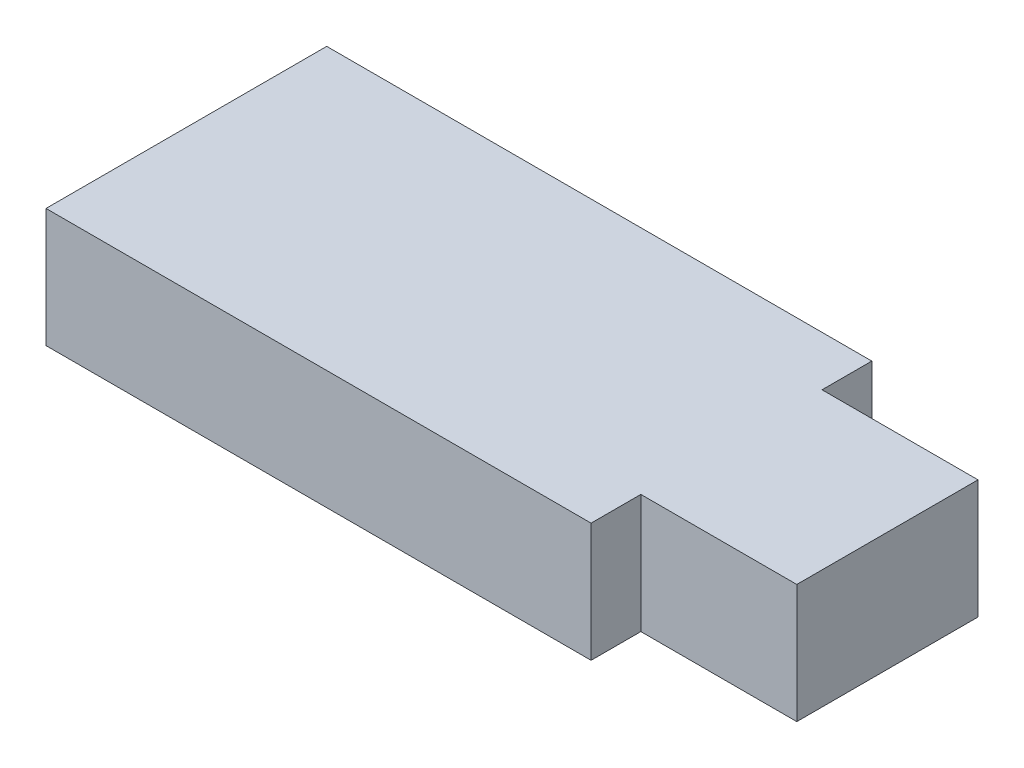
ISO-10303-21;
HEADER;
FILE_DESCRIPTION(('STEP AP214'),'2;1');
FILE_NAME('part.step','',(''),(''),'','','');
FILE_SCHEMA(('AUTOMOTIVE_DESIGN { 1 0 10303 214 1 1 1 1 }'));
ENDSEC;
DATA;
#1=APPLICATION_CONTEXT('core data for automotive mechanical design processes');
#2=APPLICATION_PROTOCOL_DEFINITION('international standard','automotive_design',2000,#1);
#3=PRODUCT_CONTEXT('',#1,'mechanical');
#4=PRODUCT('Part','Part','',(#3));
#5=PRODUCT_RELATED_PRODUCT_CATEGORY('part','',(#4));
#6=PRODUCT_DEFINITION_FORMATION('','',#4);
#7=PRODUCT_DEFINITION_CONTEXT('part definition',#1,'design');
#8=PRODUCT_DEFINITION('design','',#6,#7);
#9=PRODUCT_DEFINITION_SHAPE('','',#8);
#10=(LENGTH_UNIT() NAMED_UNIT(*) SI_UNIT(.MILLI.,.METRE.));
#11=(NAMED_UNIT(*) PLANE_ANGLE_UNIT() SI_UNIT($,.RADIAN.));
#12=(NAMED_UNIT(*) SI_UNIT($,.STERADIAN.) SOLID_ANGLE_UNIT());
#13=UNCERTAINTY_MEASURE_WITH_UNIT(LENGTH_MEASURE(1.E-05),#10,'distance_accuracy_value','');
#14=(GEOMETRIC_REPRESENTATION_CONTEXT(3) GLOBAL_UNCERTAINTY_ASSIGNED_CONTEXT((#13)) GLOBAL_UNIT_ASSIGNED_CONTEXT((#10,
#11,#12)) REPRESENTATION_CONTEXT('',''));
#15=CARTESIAN_POINT('',(0.,0.,0.));
#16=DIRECTION('',(0.,0.,1.));
#17=DIRECTION('',(1.,0.,0.));
#18=AXIS2_PLACEMENT_3D('',#15,#16,#17);
#19=CARTESIAN_POINT('',(36.7,8.,0.));
#20=DIRECTION('',(0.,0.,-1.));
#21=DIRECTION('',(-1.,0.,0.));
#22=AXIS2_PLACEMENT_3D('',#19,#20,#21);
#23=PLANE('',#22);
#24=DIRECTION('',(1.,0.,0.));
#25=VECTOR('',#24,1.);
#26=CARTESIAN_POINT('',(36.7,0.,0.));
#27=LINE('',#26,#25);
#28=CARTESIAN_POINT('',(0.,0.,0.));
#29=VERTEX_POINT('',#28);
#30=CARTESIAN_POINT('',(36.7,0.,0.));
#31=VERTEX_POINT('',#30);
#32=EDGE_CURVE('E129',#29,#31,#27,.T.);
#33=ORIENTED_EDGE('',*,*,#32,.T.);
#34=DIRECTION('',(0.,-1.,0.));
#35=VECTOR('',#34,1.);
#36=CARTESIAN_POINT('',(36.7,8.,0.));
#37=LINE('',#36,#35);
#38=CARTESIAN_POINT('',(36.7,8.,0.));
#39=VERTEX_POINT('',#38);
#40=EDGE_CURVE('E11',#39,#31,#37,.T.);
#41=ORIENTED_EDGE('',*,*,#40,.F.);
#42=DIRECTION('',(1.,0.,0.));
#43=VECTOR('',#42,1.);
#44=CARTESIAN_POINT('',(36.7,8.,0.));
#45=LINE('',#44,#43);
#46=CARTESIAN_POINT('',(0.,8.,0.));
#47=VERTEX_POINT('',#46);
#48=EDGE_CURVE('E143',#47,#39,#45,.T.);
#49=ORIENTED_EDGE('',*,*,#48,.F.);
#50=DIRECTION('',(0.,-1.,0.));
#51=VECTOR('',#50,1.);
#52=CARTESIAN_POINT('',(0.,8.,0.));
#53=LINE('',#52,#51);
#54=EDGE_CURVE('E125',#47,#29,#53,.T.);
#55=ORIENTED_EDGE('',*,*,#54,.T.);
#56=EDGE_LOOP('',(#33,#41,#49,#55));
#57=FACE_BOUND('',#56,.T.);
#58=ADVANCED_FACE('F33',(#57),#23,.F.);
#59=CARTESIAN_POINT('',(36.7,8.,-3.35));
#60=DIRECTION('',(-1.,0.,0.));
#61=DIRECTION('',(0.,0.,1.));
#62=AXIS2_PLACEMENT_3D('',#59,#60,#61);
#63=PLANE('',#62);
#64=DIRECTION('',(0.,0.,-1.));
#65=VECTOR('',#64,1.);
#66=CARTESIAN_POINT('',(36.7,0.,-3.35));
#67=LINE('',#66,#65);
#68=CARTESIAN_POINT('',(36.7,0.,-3.35));
#69=VERTEX_POINT('',#68);
#70=EDGE_CURVE('E132',#31,#69,#67,.T.);
#71=ORIENTED_EDGE('',*,*,#70,.T.);
#72=DIRECTION('',(0.,-1.,0.));
#73=VECTOR('',#72,1.);
#74=CARTESIAN_POINT('',(36.7,8.,-3.35));
#75=LINE('',#74,#73);
#76=CARTESIAN_POINT('',(36.7,8.,-3.35));
#77=VERTEX_POINT('',#76);
#78=EDGE_CURVE('E41',#77,#69,#75,.T.);
#79=ORIENTED_EDGE('',*,*,#78,.F.);
#80=DIRECTION('',(0.,0.,-1.));
#81=VECTOR('',#80,1.);
#82=CARTESIAN_POINT('',(36.7,8.,-3.35));
#83=LINE('',#82,#81);
#84=EDGE_CURVE('E92',#39,#77,#83,.T.);
#85=ORIENTED_EDGE('',*,*,#84,.F.);
#86=ORIENTED_EDGE('',*,*,#40,.T.);
#87=EDGE_LOOP('',(#71,#79,#85,#86));
#88=FACE_BOUND('',#87,.T.);
#89=ADVANCED_FACE('F178',(#88),#63,.F.);
#90=CARTESIAN_POINT('',(47.2,8.,-3.35));
#91=DIRECTION('',(0.,0.,-1.));
#92=DIRECTION('',(-1.,0.,0.));
#93=AXIS2_PLACEMENT_3D('',#90,#91,#92);
#94=PLANE('',#93);
#95=DIRECTION('',(1.,0.,0.));
#96=VECTOR('',#95,1.);
#97=CARTESIAN_POINT('',(47.2,0.,-3.35));
#98=LINE('',#97,#96);
#99=CARTESIAN_POINT('',(47.2,0.,-3.35));
#100=VERTEX_POINT('',#99);
#101=EDGE_CURVE('E134',#69,#100,#98,.T.);
#102=ORIENTED_EDGE('',*,*,#101,.T.);
#103=DIRECTION('',(0.,-1.,0.));
#104=VECTOR('',#103,1.);
#105=CARTESIAN_POINT('',(47.2,8.,-3.35));
#106=LINE('',#105,#104);
#107=CARTESIAN_POINT('',(47.2,8.,-3.35));
#108=VERTEX_POINT('',#107);
#109=EDGE_CURVE('E150',#108,#100,#106,.T.);
#110=ORIENTED_EDGE('',*,*,#109,.F.);
#111=DIRECTION('',(1.,0.,0.));
#112=VECTOR('',#111,1.);
#113=CARTESIAN_POINT('',(47.2,8.,-3.35));
#114=LINE('',#113,#112);
#115=EDGE_CURVE('E158',#77,#108,#114,.T.);
#116=ORIENTED_EDGE('',*,*,#115,.F.);
#117=ORIENTED_EDGE('',*,*,#78,.T.);
#118=EDGE_LOOP('',(#102,#110,#116,#117));
#119=FACE_BOUND('',#118,.T.);
#120=ADVANCED_FACE('F156',(#119),#94,.F.);
#121=CARTESIAN_POINT('',(47.2,8.,-15.55));
#122=DIRECTION('',(-1.,0.,0.));
#123=DIRECTION('',(0.,0.,1.));
#124=AXIS2_PLACEMENT_3D('',#121,#122,#123);
#125=PLANE('',#124);
#126=DIRECTION('',(0.,0.,-1.));
#127=VECTOR('',#126,1.);
#128=CARTESIAN_POINT('',(47.2,0.,-15.55));
#129=LINE('',#128,#127);
#130=CARTESIAN_POINT('',(47.2,0.,-15.55));
#131=VERTEX_POINT('',#130);
#132=EDGE_CURVE('E136',#100,#131,#129,.T.);
#133=ORIENTED_EDGE('',*,*,#132,.T.);
#134=DIRECTION('',(0.,-1.,0.));
#135=VECTOR('',#134,1.);
#136=CARTESIAN_POINT('',(47.2,8.,-15.55));
#137=LINE('',#136,#135);
#138=CARTESIAN_POINT('',(47.2,8.,-15.55));
#139=VERTEX_POINT('',#138);
#140=EDGE_CURVE('E147',#139,#131,#137,.T.);
#141=ORIENTED_EDGE('',*,*,#140,.F.);
#142=DIRECTION('',(0.,0.,-1.));
#143=VECTOR('',#142,1.);
#144=CARTESIAN_POINT('',(47.2,8.,-15.55));
#145=LINE('',#144,#143);
#146=EDGE_CURVE('E170',#108,#139,#145,.T.);
#147=ORIENTED_EDGE('',*,*,#146,.F.);
#148=ORIENTED_EDGE('',*,*,#109,.T.);
#149=EDGE_LOOP('',(#133,#141,#147,#148));
#150=FACE_BOUND('',#149,.T.);
#151=ADVANCED_FACE('F166',(#150),#125,.F.);
#152=CARTESIAN_POINT('',(36.7,8.,-15.55));
#153=DIRECTION('',(0.,0.,1.));
#154=DIRECTION('',(1.,0.,0.));
#155=AXIS2_PLACEMENT_3D('',#152,#153,#154);
#156=PLANE('',#155);
#157=DIRECTION('',(-1.,0.,0.));
#158=VECTOR('',#157,1.);
#159=CARTESIAN_POINT('',(36.7,0.,-15.55));
#160=LINE('',#159,#158);
#161=CARTESIAN_POINT('',(36.7,0.,-15.55));
#162=VERTEX_POINT('',#161);
#163=EDGE_CURVE('E138',#131,#162,#160,.T.);
#164=ORIENTED_EDGE('',*,*,#163,.T.);
#165=DIRECTION('',(0.,-1.,0.));
#166=VECTOR('',#165,1.);
#167=CARTESIAN_POINT('',(36.7,8.,-15.55));
#168=LINE('',#167,#166);
#169=CARTESIAN_POINT('',(36.7,8.,-15.55));
#170=VERTEX_POINT('',#169);
#171=EDGE_CURVE('E120',#170,#162,#168,.T.);
#172=ORIENTED_EDGE('',*,*,#171,.F.);
#173=DIRECTION('',(-1.,0.,0.));
#174=VECTOR('',#173,1.);
#175=CARTESIAN_POINT('',(36.7,8.,-15.55));
#176=LINE('',#175,#174);
#177=EDGE_CURVE('E111',#139,#170,#176,.T.);
#178=ORIENTED_EDGE('',*,*,#177,.F.);
#179=ORIENTED_EDGE('',*,*,#140,.T.);
#180=EDGE_LOOP('',(#164,#172,#178,#179));
#181=FACE_BOUND('',#180,.T.);
#182=ADVANCED_FACE('F169',(#181),#156,.F.);
#183=CARTESIAN_POINT('',(36.7,8.,-18.9));
#184=DIRECTION('',(-1.,0.,0.));
#185=DIRECTION('',(0.,0.,1.));
#186=AXIS2_PLACEMENT_3D('',#183,#184,#185);
#187=PLANE('',#186);
#188=DIRECTION('',(0.,0.,-1.));
#189=VECTOR('',#188,1.);
#190=CARTESIAN_POINT('',(36.7,0.,-18.9));
#191=LINE('',#190,#189);
#192=CARTESIAN_POINT('',(36.7,0.,-18.9));
#193=VERTEX_POINT('',#192);
#194=EDGE_CURVE('E119',#162,#193,#191,.T.);
#195=ORIENTED_EDGE('',*,*,#194,.T.);
#196=DIRECTION('',(0.,-1.,0.));
#197=VECTOR('',#196,1.);
#198=CARTESIAN_POINT('',(36.7,8.,-18.9));
#199=LINE('',#198,#197);
#200=CARTESIAN_POINT('',(36.7,8.,-18.9));
#201=VERTEX_POINT('',#200);
#202=EDGE_CURVE('E116',#201,#193,#199,.T.);
#203=ORIENTED_EDGE('',*,*,#202,.F.);
#204=DIRECTION('',(0.,0.,-1.));
#205=VECTOR('',#204,1.);
#206=CARTESIAN_POINT('',(36.7,8.,-18.9));
#207=LINE('',#206,#205);
#208=EDGE_CURVE('E105',#170,#201,#207,.T.);
#209=ORIENTED_EDGE('',*,*,#208,.F.);
#210=ORIENTED_EDGE('',*,*,#171,.T.);
#211=EDGE_LOOP('',(#195,#203,#209,#210));
#212=FACE_BOUND('',#211,.T.);
#213=ADVANCED_FACE('F117',(#212),#187,.F.);
#214=CARTESIAN_POINT('',(0.,8.,-18.9));
#215=DIRECTION('',(0.,0.,1.));
#216=DIRECTION('',(1.,0.,0.));
#217=AXIS2_PLACEMENT_3D('',#214,#215,#216);
#218=PLANE('',#217);
#219=DIRECTION('',(-1.,0.,0.));
#220=VECTOR('',#219,1.);
#221=CARTESIAN_POINT('',(0.,0.,-18.9));
#222=LINE('',#221,#220);
#223=CARTESIAN_POINT('',(0.,0.,-18.9));
#224=VERTEX_POINT('',#223);
#225=EDGE_CURVE('E78',#193,#224,#222,.T.);
#226=ORIENTED_EDGE('',*,*,#225,.T.);
#227=DIRECTION('',(0.,-1.,0.));
#228=VECTOR('',#227,1.);
#229=CARTESIAN_POINT('',(0.,8.,-18.9));
#230=LINE('',#229,#228);
#231=CARTESIAN_POINT('',(0.,8.,-18.9));
#232=VERTEX_POINT('',#231);
#233=EDGE_CURVE('E121',#232,#224,#230,.T.);
#234=ORIENTED_EDGE('',*,*,#233,.F.);
#235=DIRECTION('',(-1.,0.,0.));
#236=VECTOR('',#235,1.);
#237=CARTESIAN_POINT('',(0.,8.,-18.9));
#238=LINE('',#237,#236);
#239=EDGE_CURVE('E109',#201,#232,#238,.T.);
#240=ORIENTED_EDGE('',*,*,#239,.F.);
#241=ORIENTED_EDGE('',*,*,#202,.T.);
#242=EDGE_LOOP('',(#226,#234,#240,#241));
#243=FACE_BOUND('',#242,.T.);
#244=ADVANCED_FACE('F123',(#243),#218,.F.);
#245=CARTESIAN_POINT('',(0.,8.,0.));
#246=DIRECTION('',(1.,0.,0.));
#247=DIRECTION('',(0.,0.,-1.));
#248=AXIS2_PLACEMENT_3D('',#245,#246,#247);
#249=PLANE('',#248);
#250=DIRECTION('',(0.,0.,1.));
#251=VECTOR('',#250,1.);
#252=CARTESIAN_POINT('',(0.,0.,0.));
#253=LINE('',#252,#251);
#254=EDGE_CURVE('E84',#224,#29,#253,.T.);
#255=ORIENTED_EDGE('',*,*,#254,.T.);
#256=ORIENTED_EDGE('',*,*,#54,.F.);
#257=DIRECTION('',(0.,0.,1.));
#258=VECTOR('',#257,1.);
#259=CARTESIAN_POINT('',(0.,8.,0.));
#260=LINE('',#259,#258);
#261=EDGE_CURVE('E49',#232,#47,#260,.T.);
#262=ORIENTED_EDGE('',*,*,#261,.F.);
#263=ORIENTED_EDGE('',*,*,#233,.T.);
#264=EDGE_LOOP('',(#255,#256,#262,#263));
#265=FACE_BOUND('',#264,.T.);
#266=ADVANCED_FACE('F194',(#265),#249,.F.);
#267=CARTESIAN_POINT('',(0.,8.,0.));
#268=DIRECTION('',(0.,-1.,0.));
#269=DIRECTION('',(0.,0.,-1.));
#270=AXIS2_PLACEMENT_3D('',#267,#268,#269);
#271=PLANE('',#270);
#272=ORIENTED_EDGE('',*,*,#48,.T.);
#273=ORIENTED_EDGE('',*,*,#84,.T.);
#274=ORIENTED_EDGE('',*,*,#115,.T.);
#275=ORIENTED_EDGE('',*,*,#146,.T.);
#276=ORIENTED_EDGE('',*,*,#177,.T.);
#277=ORIENTED_EDGE('',*,*,#208,.T.);
#278=ORIENTED_EDGE('',*,*,#239,.T.);
#279=ORIENTED_EDGE('',*,*,#261,.T.);
#280=EDGE_LOOP('',(#272,#273,#274,#275,#276,#277,#278,#279));
#281=FACE_BOUND('',#280,.T.);
#282=ADVANCED_FACE('F107',(#281),#271,.F.);
#283=CARTESIAN_POINT('',(0.,0.,0.));
#284=DIRECTION('',(0.,-1.,0.));
#285=DIRECTION('',(0.,0.,-1.));
#286=AXIS2_PLACEMENT_3D('',#283,#284,#285);
#287=PLANE('',#286);
#288=ORIENTED_EDGE('',*,*,#32,.F.);
#289=ORIENTED_EDGE('',*,*,#254,.F.);
#290=ORIENTED_EDGE('',*,*,#225,.F.);
#291=ORIENTED_EDGE('',*,*,#194,.F.);
#292=ORIENTED_EDGE('',*,*,#163,.F.);
#293=ORIENTED_EDGE('',*,*,#132,.F.);
#294=ORIENTED_EDGE('',*,*,#101,.F.);
#295=ORIENTED_EDGE('',*,*,#70,.F.);
#296=EDGE_LOOP('',(#288,#289,#290,#291,#292,#293,#294,#295));
#297=FACE_BOUND('',#296,.T.);
#298=ADVANCED_FACE('F162',(#297),#287,.T.);
#299=CLOSED_SHELL('',(#58,#89,#120,#151,#182,#213,#244,#266,#282,#298));
#300=MANIFOLD_SOLID_BREP('B2',#299);
#301=ADVANCED_BREP_SHAPE_REPRESENTATION('',(#18,#300),#14);
#302=SHAPE_DEFINITION_REPRESENTATION(#9,#301);
ENDSEC;
END-ISO-10303-21;
